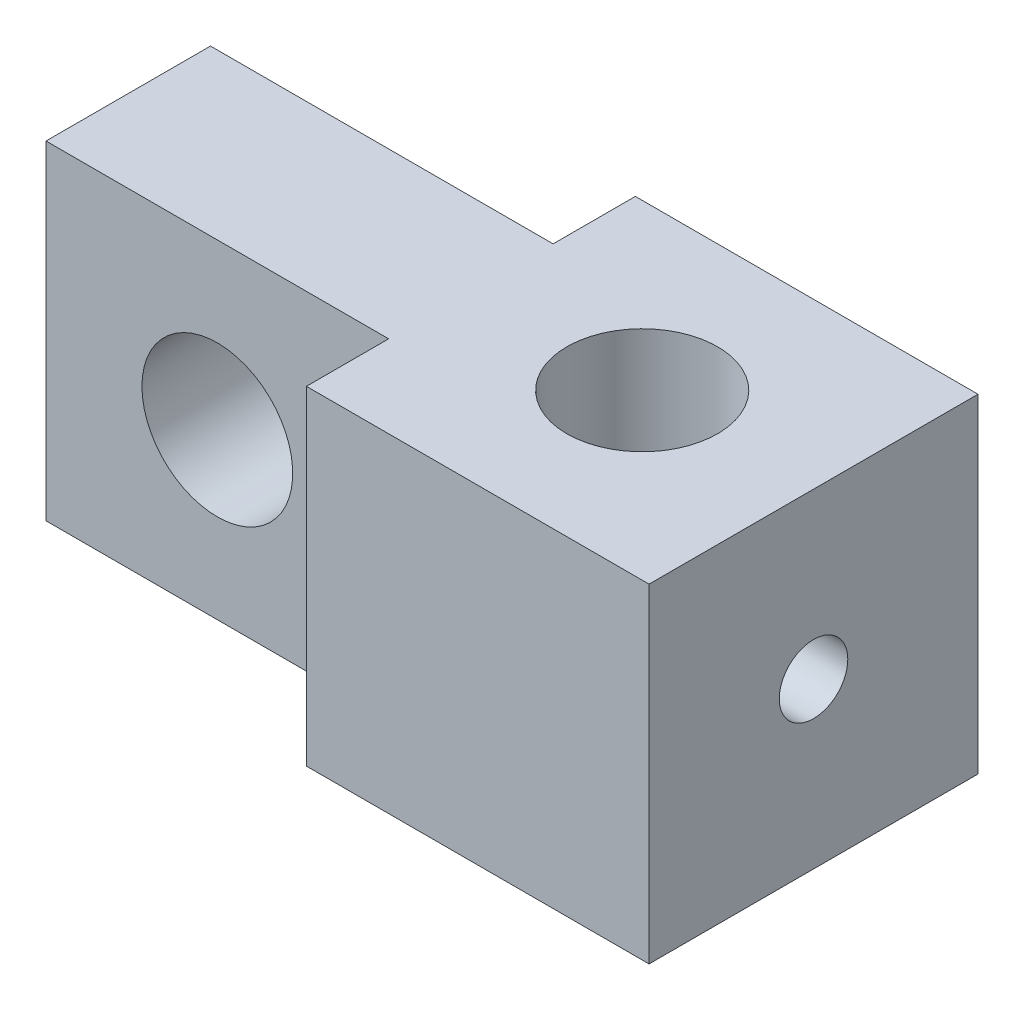
ISO-10303-21;
HEADER;
FILE_DESCRIPTION(('STEP AP214'),'2;1');
FILE_NAME('part.step','',(''),(''),'','','');
FILE_SCHEMA(('AUTOMOTIVE_DESIGN { 1 0 10303 214 1 1 1 1 }'));
ENDSEC;
DATA;
#1=APPLICATION_CONTEXT('core data for automotive mechanical design processes');
#2=APPLICATION_PROTOCOL_DEFINITION('international standard','automotive_design',2000,#1);
#3=PRODUCT_CONTEXT('',#1,'mechanical');
#4=PRODUCT('Part','Part','',(#3));
#5=PRODUCT_RELATED_PRODUCT_CATEGORY('part','',(#4));
#6=PRODUCT_DEFINITION_FORMATION('','',#4);
#7=PRODUCT_DEFINITION_CONTEXT('part definition',#1,'design');
#8=PRODUCT_DEFINITION('design','',#6,#7);
#9=PRODUCT_DEFINITION_SHAPE('','',#8);
#10=(LENGTH_UNIT() NAMED_UNIT(*) SI_UNIT(.MILLI.,.METRE.));
#11=(NAMED_UNIT(*) PLANE_ANGLE_UNIT() SI_UNIT($,.RADIAN.));
#12=(NAMED_UNIT(*) SI_UNIT($,.STERADIAN.) SOLID_ANGLE_UNIT());
#13=UNCERTAINTY_MEASURE_WITH_UNIT(LENGTH_MEASURE(1.E-05),#10,'distance_accuracy_value','');
#14=(GEOMETRIC_REPRESENTATION_CONTEXT(3) GLOBAL_UNCERTAINTY_ASSIGNED_CONTEXT((#13)) GLOBAL_UNIT_ASSIGNED_CONTEXT((#10,
#11,#12)) REPRESENTATION_CONTEXT('',''));
#15=CARTESIAN_POINT('',(0.,0.,0.));
#16=DIRECTION('',(0.,0.,1.));
#17=DIRECTION('',(1.,0.,0.));
#18=AXIS2_PLACEMENT_3D('',#15,#16,#17);
#19=CARTESIAN_POINT('',(0.,0.,6.));
#20=DIRECTION('',(0.,0.,1.));
#21=DIRECTION('',(1.,0.,0.));
#22=AXIS2_PLACEMENT_3D('',#19,#20,#21);
#23=PLANE('',#22);
#24=DIRECTION('',(0.,1.,0.));
#25=VECTOR('',#24,1.);
#26=CARTESIAN_POINT('',(0.,-6.,6.));
#27=LINE('',#26,#25);
#28=CARTESIAN_POINT('',(0.,-6.,6.));
#29=VERTEX_POINT('',#28);
#30=CARTESIAN_POINT('',(0.,6.,6.));
#31=VERTEX_POINT('',#30);
#32=EDGE_CURVE('E50',#29,#31,#27,.T.);
#33=ORIENTED_EDGE('',*,*,#32,.F.);
#34=DIRECTION('',(1.,0.,0.));
#35=VECTOR('',#34,1.);
#36=CARTESIAN_POINT('',(-12.5,-6.,6.));
#37=LINE('',#36,#35);
#38=CARTESIAN_POINT('',(12.5,-6.,6.));
#39=VERTEX_POINT('',#38);
#40=EDGE_CURVE('E112',#29,#39,#37,.T.);
#41=ORIENTED_EDGE('',*,*,#40,.T.);
#42=DIRECTION('',(0.,1.,0.));
#43=VECTOR('',#42,1.);
#44=CARTESIAN_POINT('',(12.5,6.,6.));
#45=LINE('',#44,#43);
#46=CARTESIAN_POINT('',(12.5,6.,6.));
#47=VERTEX_POINT('',#46);
#48=EDGE_CURVE('E120',#39,#47,#45,.T.);
#49=ORIENTED_EDGE('',*,*,#48,.T.);
#50=DIRECTION('',(-1.,0.,0.));
#51=VECTOR('',#50,1.);
#52=CARTESIAN_POINT('',(-12.5,6.,6.));
#53=LINE('',#52,#51);
#54=EDGE_CURVE('E115',#47,#31,#53,.T.);
#55=ORIENTED_EDGE('',*,*,#54,.T.);
#56=EDGE_LOOP('',(#33,#41,#49,#55));
#57=FACE_BOUND('',#56,.T.);
#58=ADVANCED_FACE('F33',(#57),#23,.T.);
#59=CARTESIAN_POINT('',(0.,0.,-6.));
#60=DIRECTION('',(0.,0.,1.));
#61=DIRECTION('',(1.,0.,0.));
#62=AXIS2_PLACEMENT_3D('',#59,#60,#61);
#63=PLANE('',#62);
#64=DIRECTION('',(1.,0.,0.));
#65=VECTOR('',#64,1.);
#66=CARTESIAN_POINT('',(-12.5,-6.,-6.));
#67=LINE('',#66,#65);
#68=CARTESIAN_POINT('',(0.,-6.,-6.));
#69=VERTEX_POINT('',#68);
#70=CARTESIAN_POINT('',(12.5,-6.,-6.));
#71=VERTEX_POINT('',#70);
#72=EDGE_CURVE('E132',#69,#71,#67,.T.);
#73=ORIENTED_EDGE('',*,*,#72,.F.);
#74=DIRECTION('',(0.,1.,0.));
#75=VECTOR('',#74,1.);
#76=CARTESIAN_POINT('',(0.,-6.,-6.));
#77=LINE('',#76,#75);
#78=CARTESIAN_POINT('',(0.,6.,-6.));
#79=VERTEX_POINT('',#78);
#80=EDGE_CURVE('E141',#69,#79,#77,.T.);
#81=ORIENTED_EDGE('',*,*,#80,.T.);
#82=DIRECTION('',(-1.,0.,0.));
#83=VECTOR('',#82,1.);
#84=CARTESIAN_POINT('',(-12.5,6.,-6.));
#85=LINE('',#84,#83);
#86=CARTESIAN_POINT('',(12.5,6.,-6.));
#87=VERTEX_POINT('',#86);
#88=EDGE_CURVE('E121',#87,#79,#85,.T.);
#89=ORIENTED_EDGE('',*,*,#88,.F.);
#90=DIRECTION('',(0.,1.,0.));
#91=VECTOR('',#90,1.);
#92=CARTESIAN_POINT('',(12.5,6.,-6.));
#93=LINE('',#92,#91);
#94=EDGE_CURVE('E125',#71,#87,#93,.T.);
#95=ORIENTED_EDGE('',*,*,#94,.F.);
#96=EDGE_LOOP('',(#73,#81,#89,#95));
#97=FACE_BOUND('',#96,.T.);
#98=ADVANCED_FACE('F214',(#97),#63,.F.);
#99=CARTESIAN_POINT('',(-12.5,6.,6.));
#100=DIRECTION('',(1.,0.,0.));
#101=DIRECTION('',(0.,0.,-1.));
#102=AXIS2_PLACEMENT_3D('',#99,#100,#101);
#103=PLANE('',#102);
#104=DIRECTION('',(0.,0.,-1.));
#105=VECTOR('',#104,1.);
#106=CARTESIAN_POINT('',(-12.5,-6.,6.));
#107=LINE('',#106,#105);
#108=CARTESIAN_POINT('',(-12.5,-6.,3.));
#109=VERTEX_POINT('',#108);
#110=CARTESIAN_POINT('',(-12.5,-6.,-3.));
#111=VERTEX_POINT('',#110);
#112=EDGE_CURVE('E11',#109,#111,#107,.T.);
#113=ORIENTED_EDGE('',*,*,#112,.F.);
#114=DIRECTION('',(0.,1.,0.));
#115=VECTOR('',#114,1.);
#116=CARTESIAN_POINT('',(-12.5,-6.,3.));
#117=LINE('',#116,#115);
#118=CARTESIAN_POINT('',(-12.5,6.,3.));
#119=VERTEX_POINT('',#118);
#120=EDGE_CURVE('E163',#109,#119,#117,.T.);
#121=ORIENTED_EDGE('',*,*,#120,.T.);
#122=DIRECTION('',(0.,0.,-1.));
#123=VECTOR('',#122,1.);
#124=CARTESIAN_POINT('',(-12.5,6.,6.));
#125=LINE('',#124,#123);
#126=CARTESIAN_POINT('',(-12.5,6.,-3.));
#127=VERTEX_POINT('',#126);
#128=EDGE_CURVE('E58',#119,#127,#125,.T.);
#129=ORIENTED_EDGE('',*,*,#128,.T.);
#130=DIRECTION('',(0.,1.,0.));
#131=VECTOR('',#130,1.);
#132=CARTESIAN_POINT('',(-12.5,-6.,-3.));
#133=LINE('',#132,#131);
#134=EDGE_CURVE('E128',#111,#127,#133,.T.);
#135=ORIENTED_EDGE('',*,*,#134,.F.);
#136=EDGE_LOOP('',(#113,#121,#129,#135));
#137=FACE_BOUND('',#136,.T.);
#138=ADVANCED_FACE('F35',(#137),#103,.F.);
#139=CARTESIAN_POINT('',(-12.5,-6.,6.));
#140=DIRECTION('',(0.,1.,0.));
#141=DIRECTION('',(0.,0.,1.));
#142=AXIS2_PLACEMENT_3D('',#139,#140,#141);
#143=PLANE('',#142);
#144=CARTESIAN_POINT('',(6.25,-6.,0.));
#145=DIRECTION('',(0.,1.,0.));
#146=DIRECTION('',(0.,0.,1.));
#147=AXIS2_PLACEMENT_3D('',#144,#145,#146);
#148=CIRCLE('',#147,2.75);
#149=CARTESIAN_POINT('',(6.25,-6.,2.75));
#150=VERTEX_POINT('',#149);
#151=EDGE_CURVE('E168',#150,#150,#148,.T.);
#152=ORIENTED_EDGE('',*,*,#151,.T.);
#153=EDGE_LOOP('',(#152));
#154=FACE_BOUND('',#153,.T.);
#155=DIRECTION('',(0.,0.,-1.));
#156=VECTOR('',#155,1.);
#157=CARTESIAN_POINT('',(0.,-6.,6.));
#158=LINE('',#157,#156);
#159=CARTESIAN_POINT('',(0.,-6.,3.));
#160=VERTEX_POINT('',#159);
#161=EDGE_CURVE('E100',#29,#160,#158,.T.);
#162=ORIENTED_EDGE('',*,*,#161,.T.);
#163=DIRECTION('',(-1.,0.,0.));
#164=VECTOR('',#163,1.);
#165=CARTESIAN_POINT('',(-12.5,-6.,3.));
#166=LINE('',#165,#164);
#167=EDGE_CURVE('E107',#160,#109,#166,.T.);
#168=ORIENTED_EDGE('',*,*,#167,.T.);
#169=ORIENTED_EDGE('',*,*,#112,.T.);
#170=DIRECTION('',(1.,0.,0.));
#171=VECTOR('',#170,1.);
#172=CARTESIAN_POINT('',(-12.5,-6.,-3.));
#173=LINE('',#172,#171);
#174=CARTESIAN_POINT('',(0.,-6.,-3.));
#175=VERTEX_POINT('',#174);
#176=EDGE_CURVE('E153',#111,#175,#173,.T.);
#177=ORIENTED_EDGE('',*,*,#176,.T.);
#178=DIRECTION('',(0.,0.,-1.));
#179=VECTOR('',#178,1.);
#180=CARTESIAN_POINT('',(0.,-6.,-6.));
#181=LINE('',#180,#179);
#182=EDGE_CURVE('E157',#175,#69,#181,.T.);
#183=ORIENTED_EDGE('',*,*,#182,.T.);
#184=ORIENTED_EDGE('',*,*,#72,.T.);
#185=DIRECTION('',(0.,0.,-1.));
#186=VECTOR('',#185,1.);
#187=CARTESIAN_POINT('',(12.5,-6.,6.));
#188=LINE('',#187,#186);
#189=EDGE_CURVE('E42',#39,#71,#188,.T.);
#190=ORIENTED_EDGE('',*,*,#189,.F.);
#191=ORIENTED_EDGE('',*,*,#40,.F.);
#192=EDGE_LOOP('',(#162,#168,#169,#177,#183,#184,#190,#191));
#193=FACE_BOUND('',#192,.T.);
#194=ADVANCED_FACE('F117',(#154,#193),#143,.F.);
#195=CARTESIAN_POINT('',(12.5,6.,6.));
#196=DIRECTION('',(-1.,0.,0.));
#197=DIRECTION('',(0.,0.,1.));
#198=AXIS2_PLACEMENT_3D('',#195,#196,#197);
#199=PLANE('',#198);
#200=CARTESIAN_POINT('',(12.5,0.,0.));
#201=DIRECTION('',(1.,0.,0.));
#202=DIRECTION('',(0.,0.,-1.));
#203=AXIS2_PLACEMENT_3D('',#200,#201,#202);
#204=CIRCLE('',#203,1.25);
#205=CARTESIAN_POINT('',(12.5,0.,-1.25));
#206=VERTEX_POINT('',#205);
#207=EDGE_CURVE('E173',#206,#206,#204,.T.);
#208=ORIENTED_EDGE('',*,*,#207,.F.);
#209=EDGE_LOOP('',(#208));
#210=FACE_BOUND('',#209,.T.);
#211=ORIENTED_EDGE('',*,*,#94,.T.);
#212=DIRECTION('',(0.,0.,-1.));
#213=VECTOR('',#212,1.);
#214=CARTESIAN_POINT('',(12.5,6.,6.));
#215=LINE('',#214,#213);
#216=EDGE_CURVE('E137',#47,#87,#215,.T.);
#217=ORIENTED_EDGE('',*,*,#216,.F.);
#218=ORIENTED_EDGE('',*,*,#48,.F.);
#219=ORIENTED_EDGE('',*,*,#189,.T.);
#220=EDGE_LOOP('',(#211,#217,#218,#219));
#221=FACE_BOUND('',#220,.T.);
#222=ADVANCED_FACE('F219',(#210,#221),#199,.F.);
#223=CARTESIAN_POINT('',(-12.5,6.,6.));
#224=DIRECTION('',(0.,-1.,0.));
#225=DIRECTION('',(0.,0.,-1.));
#226=AXIS2_PLACEMENT_3D('',#223,#224,#225);
#227=PLANE('',#226);
#228=CARTESIAN_POINT('',(6.25,6.,0.));
#229=DIRECTION('',(0.,1.,0.));
#230=DIRECTION('',(0.,0.,1.));
#231=AXIS2_PLACEMENT_3D('',#228,#229,#230);
#232=CIRCLE('',#231,2.75);
#233=CARTESIAN_POINT('',(6.25,6.,2.75));
#234=VERTEX_POINT('',#233);
#235=EDGE_CURVE('E170',#234,#234,#232,.T.);
#236=ORIENTED_EDGE('',*,*,#235,.F.);
#237=EDGE_LOOP('',(#236));
#238=FACE_BOUND('',#237,.T.);
#239=ORIENTED_EDGE('',*,*,#128,.F.);
#240=DIRECTION('',(-1.,0.,0.));
#241=VECTOR('',#240,1.);
#242=CARTESIAN_POINT('',(-12.5,6.,3.));
#243=LINE('',#242,#241);
#244=CARTESIAN_POINT('',(0.,6.,3.));
#245=VERTEX_POINT('',#244);
#246=EDGE_CURVE('E108',#245,#119,#243,.T.);
#247=ORIENTED_EDGE('',*,*,#246,.F.);
#248=DIRECTION('',(0.,0.,-1.));
#249=VECTOR('',#248,1.);
#250=CARTESIAN_POINT('',(0.,6.,6.));
#251=LINE('',#250,#249);
#252=EDGE_CURVE('E166',#31,#245,#251,.T.);
#253=ORIENTED_EDGE('',*,*,#252,.F.);
#254=ORIENTED_EDGE('',*,*,#54,.F.);
#255=ORIENTED_EDGE('',*,*,#216,.T.);
#256=ORIENTED_EDGE('',*,*,#88,.T.);
#257=DIRECTION('',(0.,0.,-1.));
#258=VECTOR('',#257,1.);
#259=CARTESIAN_POINT('',(0.,6.,-6.));
#260=LINE('',#259,#258);
#261=CARTESIAN_POINT('',(0.,6.,-3.));
#262=VERTEX_POINT('',#261);
#263=EDGE_CURVE('E151',#262,#79,#260,.T.);
#264=ORIENTED_EDGE('',*,*,#263,.F.);
#265=DIRECTION('',(1.,0.,0.));
#266=VECTOR('',#265,1.);
#267=CARTESIAN_POINT('',(-12.5,6.,-3.));
#268=LINE('',#267,#266);
#269=EDGE_CURVE('E154',#127,#262,#268,.T.);
#270=ORIENTED_EDGE('',*,*,#269,.F.);
#271=EDGE_LOOP('',(#239,#247,#253,#254,#255,#256,#264,#270));
#272=FACE_BOUND('',#271,.T.);
#273=ADVANCED_FACE('F210',(#238,#272),#227,.F.);
#274=CARTESIAN_POINT('',(-6.25,0.,6.));
#275=DIRECTION('',(0.,0.,-1.));
#276=DIRECTION('',(-1.,0.,0.));
#277=AXIS2_PLACEMENT_3D('',#274,#275,#276);
#278=CYLINDRICAL_SURFACE('',#277,2.75);
#279=CARTESIAN_POINT('',(-6.25,0.,3.));
#280=DIRECTION('',(0.,0.,-1.));
#281=DIRECTION('',(-1.,0.,0.));
#282=AXIS2_PLACEMENT_3D('',#279,#280,#281);
#283=CIRCLE('',#282,2.75);
#284=CARTESIAN_POINT('',(-9.,0.,3.));
#285=VERTEX_POINT('',#284);
#286=EDGE_CURVE('E37',#285,#285,#283,.T.);
#287=ORIENTED_EDGE('',*,*,#286,.F.);
#288=EDGE_LOOP('',(#287));
#289=FACE_BOUND('',#288,.T.);
#290=CARTESIAN_POINT('',(-6.25,0.,-3.));
#291=DIRECTION('',(0.,0.,1.));
#292=DIRECTION('',(1.,0.,0.));
#293=AXIS2_PLACEMENT_3D('',#290,#291,#292);
#294=CIRCLE('',#293,2.75);
#295=CARTESIAN_POINT('',(-3.5,0.,-3.));
#296=VERTEX_POINT('',#295);
#297=EDGE_CURVE('E134',#296,#296,#294,.T.);
#298=ORIENTED_EDGE('',*,*,#297,.F.);
#299=EDGE_LOOP('',(#298));
#300=FACE_BOUND('',#299,.T.);
#301=ADVANCED_FACE('F204',(#289,#300),#278,.F.);
#302=CARTESIAN_POINT('',(0.,-6.,-6.));
#303=DIRECTION('',(1.,0.,0.));
#304=DIRECTION('',(0.,0.,-1.));
#305=AXIS2_PLACEMENT_3D('',#302,#303,#304);
#306=PLANE('',#305);
#307=ORIENTED_EDGE('',*,*,#263,.T.);
#308=ORIENTED_EDGE('',*,*,#80,.F.);
#309=ORIENTED_EDGE('',*,*,#182,.F.);
#310=DIRECTION('',(0.,1.,0.));
#311=VECTOR('',#310,1.);
#312=CARTESIAN_POINT('',(0.,-6.,-3.));
#313=LINE('',#312,#311);
#314=EDGE_CURVE('E145',#175,#262,#313,.T.);
#315=ORIENTED_EDGE('',*,*,#314,.T.);
#316=EDGE_LOOP('',(#307,#308,#309,#315));
#317=FACE_BOUND('',#316,.T.);
#318=ADVANCED_FACE('F201',(#317),#306,.F.);
#319=CARTESIAN_POINT('',(-12.5,-6.,-3.));
#320=DIRECTION('',(0.,0.,1.));
#321=DIRECTION('',(1.,0.,0.));
#322=AXIS2_PLACEMENT_3D('',#319,#320,#321);
#323=PLANE('',#322);
#324=ORIENTED_EDGE('',*,*,#297,.T.);
#325=EDGE_LOOP('',(#324));
#326=FACE_BOUND('',#325,.T.);
#327=ORIENTED_EDGE('',*,*,#269,.T.);
#328=ORIENTED_EDGE('',*,*,#314,.F.);
#329=ORIENTED_EDGE('',*,*,#176,.F.);
#330=ORIENTED_EDGE('',*,*,#134,.T.);
#331=EDGE_LOOP('',(#327,#328,#329,#330));
#332=FACE_BOUND('',#331,.T.);
#333=ADVANCED_FACE('F197',(#326,#332),#323,.F.);
#334=CARTESIAN_POINT('',(-12.5,-6.,3.));
#335=DIRECTION('',(0.,0.,-1.));
#336=DIRECTION('',(-1.,0.,0.));
#337=AXIS2_PLACEMENT_3D('',#334,#335,#336);
#338=PLANE('',#337);
#339=ORIENTED_EDGE('',*,*,#286,.T.);
#340=EDGE_LOOP('',(#339));
#341=FACE_BOUND('',#340,.T.);
#342=ORIENTED_EDGE('',*,*,#246,.T.);
#343=ORIENTED_EDGE('',*,*,#120,.F.);
#344=ORIENTED_EDGE('',*,*,#167,.F.);
#345=DIRECTION('',(0.,1.,0.));
#346=VECTOR('',#345,1.);
#347=CARTESIAN_POINT('',(0.,-6.,3.));
#348=LINE('',#347,#346);
#349=EDGE_CURVE('E102',#160,#245,#348,.T.);
#350=ORIENTED_EDGE('',*,*,#349,.T.);
#351=EDGE_LOOP('',(#342,#343,#344,#350));
#352=FACE_BOUND('',#351,.T.);
#353=ADVANCED_FACE('F194',(#341,#352),#338,.F.);
#354=CARTESIAN_POINT('',(0.,-6.,6.));
#355=DIRECTION('',(1.,0.,0.));
#356=DIRECTION('',(0.,0.,-1.));
#357=AXIS2_PLACEMENT_3D('',#354,#355,#356);
#358=PLANE('',#357);
#359=ORIENTED_EDGE('',*,*,#252,.T.);
#360=ORIENTED_EDGE('',*,*,#349,.F.);
#361=ORIENTED_EDGE('',*,*,#161,.F.);
#362=ORIENTED_EDGE('',*,*,#32,.T.);
#363=EDGE_LOOP('',(#359,#360,#361,#362));
#364=FACE_BOUND('',#363,.T.);
#365=ADVANCED_FACE('F101',(#364),#358,.F.);
#366=CARTESIAN_POINT('',(6.25,-6.,0.));
#367=DIRECTION('',(0.,1.,0.));
#368=DIRECTION('',(0.,0.,1.));
#369=AXIS2_PLACEMENT_3D('',#366,#367,#368);
#370=CYLINDRICAL_SURFACE('',#369,2.75);
#371=CARTESIAN_POINT('',(8.69948974278318,0.,-1.25));
#372=CARTESIAN_POINT('',(8.69949368228765,-0.0660084287767302,-1.24999649350401));
#373=CARTESIAN_POINT('',(8.70219701957715,-0.132119822013389,-1.24473782444839));
#374=CARTESIAN_POINT('',(8.71264090706275,-0.262382350963878,-1.22393957837268));
#375=CARTESIAN_POINT('',(8.72039386281898,-0.326528250543144,-1.20837468013772));
#376=CARTESIAN_POINT('',(8.7398625437228,-0.450738534262838,-1.16772642001968));
#377=CARTESIAN_POINT('',(8.75155999360655,-0.510820234270489,-1.14268689094073));
#378=CARTESIAN_POINT('',(8.77757186133796,-0.625915092937396,-1.08393224916963));
#379=CARTESIAN_POINT('',(8.79188600196967,-0.680928787580735,-1.0502180553298));
#380=CARTESIAN_POINT('',(8.82270625364897,-0.788447136632088,-0.972392408700567));
#381=CARTESIAN_POINT('',(8.83929511801968,-0.840531232248649,-0.927732432282868));
#382=CARTESIAN_POINT('',(8.87212163999063,-0.936788274207381,-0.83043006696106));
#383=CARTESIAN_POINT('',(8.88835914368329,-0.980957813013366,-0.777784257759751));
#384=CARTESIAN_POINT('',(8.91969243866209,-1.06242556643034,-0.662562027156216));
#385=CARTESIAN_POINT('',(8.93468107121253,-1.09923134724531,-0.599605600022139));
#386=CARTESIAN_POINT('',(8.96078910043921,-1.16154249571663,-0.467587746509004));
#387=CARTESIAN_POINT('',(8.97191052506912,-1.18705378809647,-0.3985295437857));
#388=CARTESIAN_POINT('',(8.98844039615751,-1.22446716705338,-0.260702263713023));
#389=CARTESIAN_POINT('',(8.99415398467794,-1.23709974866422,-0.192168860207233));
#390=CARTESIAN_POINT('',(9.00034616684861,-1.25077724031198,-0.0537337492110699));
#391=CARTESIAN_POINT('',(9.00082731987365,-1.25182781553358,0.0161672725634619));
#392=CARTESIAN_POINT('',(8.99666518415707,-1.24265098655335,0.149965080853623));
#393=CARTESIAN_POINT('',(8.99238926124843,-1.23323213235261,0.213931079826317));
#394=CARTESIAN_POINT('',(8.97972015837753,-1.20479606682559,0.339258309266341));
#395=CARTESIAN_POINT('',(8.97132667311911,-1.18577814377447,0.400619346222468));
#396=CARTESIAN_POINT('',(8.95105493201454,-1.13848998410525,0.520129625913246));
#397=CARTESIAN_POINT('',(8.93912586975713,-1.11008410479753,0.578216222535323));
#398=CARTESIAN_POINT('',(8.91291017293157,-1.04497733314685,0.688949986561351));
#399=CARTESIAN_POINT('',(8.89862267537057,-1.00827340257749,0.741595151340298));
#400=CARTESIAN_POINT('',(8.8677092389954,-0.924150244355839,0.844521462681012));
#401=CARTESIAN_POINT('',(8.85098761803526,-0.876101352862837,0.894259880394284));
#402=CARTESIAN_POINT('',(8.81790977516793,-0.772382876987363,0.98523466528176));
#403=CARTESIAN_POINT('',(8.801553755853,-0.71670918353218,1.02646641790382));
#404=CARTESIAN_POINT('',(8.77029978809172,-0.5961900503594,1.10104506894183));
#405=CARTESIAN_POINT('',(8.75550118974752,-0.53104375001056,1.13395121798234));
#406=CARTESIAN_POINT('',(8.73028797326795,-0.395289669846359,1.18809667415591));
#407=CARTESIAN_POINT('',(8.71986954528397,-0.324686699764859,1.20934612514665));
#408=CARTESIAN_POINT('',(8.70559834607939,-0.185471789564966,1.23805393738082));
#409=CARTESIAN_POINT('',(8.70132366398273,-0.117087689105074,1.24640186410719));
#410=CARTESIAN_POINT('',(8.69861334601462,0.0202232972106237,1.25172089001372));
#411=CARTESIAN_POINT('',(8.7001749518254,0.0891499112995525,1.24869736351006));
#412=CARTESIAN_POINT('',(8.70851920297554,0.219568266954127,1.23217422693461));
#413=CARTESIAN_POINT('',(8.71486058692079,0.281204327780296,1.21955926621107));
#414=CARTESIAN_POINT('',(8.73144703005369,0.401407597426304,1.18544405201489));
#415=CARTESIAN_POINT('',(8.74169312725522,0.459973985502817,1.16394143575354));
#416=CARTESIAN_POINT('',(8.76549375704146,0.575365236199451,1.11159822979467));
#417=CARTESIAN_POINT('',(8.77917735570445,0.631990372421137,1.08037807246866));
#418=CARTESIAN_POINT('',(8.80815836558198,0.739499600550339,1.00984087724324));
#419=CARTESIAN_POINT('',(8.82345655287928,0.790380907034867,0.970519936824044));
#420=CARTESIAN_POINT('',(8.85579094908277,0.890281305937399,0.880267857698434));
#421=CARTESIAN_POINT('',(8.87284763397897,0.938602233674575,0.828567938261524));
#422=CARTESIAN_POINT('',(8.90539591051489,1.02604911327505,0.717441468187276));
#423=CARTESIAN_POINT('',(8.92088723447428,1.06517349401948,0.658013600012913));
#424=CARTESIAN_POINT('',(8.94881612600612,1.13339748332452,0.532064634336914));
#425=CARTESIAN_POINT('',(8.96121763780736,1.16238019367691,0.465471699055596));
#426=CARTESIAN_POINT('',(8.98129834562412,1.20848045633376,0.32763598048205));
#427=CARTESIAN_POINT('',(8.98898094374761,1.22560655781336,0.256396588146287));
#428=CARTESIAN_POINT('',(8.99830068808534,1.24628759006366,0.117466176582589));
#429=CARTESIAN_POINT('',(9.00037367442807,1.25082169423424,0.0499494636179373));
#430=CARTESIAN_POINT('',(8.99951533998593,1.24893412790421,-0.0848898576600104));
#431=CARTESIAN_POINT('',(8.99658522376393,1.24251509451602,-0.152212508787338));
#432=CARTESIAN_POINT('',(8.98629690997646,1.21959722272619,-0.281391999197495));
#433=CARTESIAN_POINT('',(8.9791576129465,1.2035960996597,-0.343356169931416));
#434=CARTESIAN_POINT('',(8.96131278427636,1.16256495626254,-0.463664188063035));
#435=CARTESIAN_POINT('',(8.95060664770133,1.13753340431434,-0.522007419358067));
#436=CARTESIAN_POINT('',(8.9260233581899,1.07790145857027,-0.636378008545816));
#437=CARTESIAN_POINT('',(8.91202358016364,1.04291581669571,-0.692177439915823));
#438=CARTESIAN_POINT('',(8.88243399966462,0.964889219457324,-0.79735904510521));
#439=CARTESIAN_POINT('',(8.86684350365391,0.921844743630817,-0.846738398309347));
#440=CARTESIAN_POINT('',(8.8341761482303,0.824757235269181,-0.941951228398709));
#441=CARTESIAN_POINT('',(8.81708296999994,0.770099102757161,-0.987154004244788));
#442=CARTESIAN_POINT('',(8.78455914709152,0.653541400342759,-1.06790018403238));
#443=CARTESIAN_POINT('',(8.76912960228939,0.591637095502227,-1.10343722102545));
#444=CARTESIAN_POINT('',(8.74176565985743,0.461487542492061,-1.16392442382467));
#445=CARTESIAN_POINT('',(8.72986003874526,0.393195774976169,-1.18878813351711));
#446=CARTESIAN_POINT('',(8.71152275925821,0.252764165808893,-1.22631765086683));
#447=CARTESIAN_POINT('',(8.70507273502283,0.180638110745491,-1.23902440311467));
#448=CARTESIAN_POINT('',(8.70107611117236,0.0900089019027595,-1.24688636059436));
#449=CARTESIAN_POINT('',(8.70048261290848,0.0720345562265871,-1.24805272823733));
#450=CARTESIAN_POINT('',(8.69968888381115,0.0360427007122043,-1.2496100405375));
#451=CARTESIAN_POINT('',(8.69948866700671,0.0180251893571555,-1.25000095753308));
#452=CARTESIAN_POINT('',(8.69948974278318,0.,-1.25));
#453=B_SPLINE_CURVE_WITH_KNOTS('',3,(#371,#372,#373,#374,#375,#376,#377,#378,#379,#380,#381,
#382,#383,#384,#385,#386,#387,#388,#389,#390,#391,#392,#393,#394,#395,#396,#397,#398,#399,#400,
#401,#402,#403,#404,#405,#406,#407,#408,#409,#410,#411,#412,#413,#414,#415,#416,#417,#418,#419,
#420,#421,#422,#423,#424,#425,#426,#427,#428,#429,#430,#431,#432,#433,#434,#435,#436,#437,#438,
#439,#440,#441,#442,#443,#444,#445,#446,#447,#448,#449,#450,#451,#452),.UNSPECIFIED.,.T.,.F.,(4,
2,2,2,2,2,2,2,2,2,2,2,2,2,2,2,2,2,2,2,2,2,2,2,2,2,2,2,2,2,2,2,2,2,2,2,2,2,2,2,4),(0.,
0.197949490145133,0.396387132894558,0.593917744022092,0.791427440589958,1.00227982105295,
1.21322276498815,1.43542192427071,1.65750438655095,1.86613997239169,2.07467350237463,
2.26815547775456,2.46165180100119,2.65807591784026,2.85457206969011,3.06708946120133,
3.27972183419202,3.50196731162577,3.72401907920019,3.92994297853522,4.13576956743683,
4.32461933407749,4.51351933887032,4.71099397075556,4.90856395864764,5.12594226056978,
5.34335767200034,5.56320241144759,5.78288846688928,5.98493699995732,6.18693689403808,
6.37925788088371,6.57161150192545,6.77276176443707,6.97400010437291,7.19187634216838,
7.40989575221212,7.62964928571055,7.8486600571131,7.90271299908978,7.95676786918959),.UNSPECIFIED.);
#454=CARTESIAN_POINT('',(8.69948974278318,0.,-1.25));
#455=VERTEX_POINT('',#454);
#456=EDGE_CURVE('E178',#455,#455,#453,.T.);
#457=ORIENTED_EDGE('',*,*,#456,.F.);
#458=EDGE_LOOP('',(#457));
#459=FACE_BOUND('',#458,.T.);
#460=ORIENTED_EDGE('',*,*,#151,.F.);
#461=EDGE_LOOP('',(#460));
#462=FACE_BOUND('',#461,.T.);
#463=ORIENTED_EDGE('',*,*,#235,.T.);
#464=EDGE_LOOP('',(#463));
#465=FACE_BOUND('',#464,.T.);
#466=ADVANCED_FACE('F189',(#459,#462,#465),#370,.F.);
#467=CARTESIAN_POINT('',(-12.501,0.,0.));
#468=DIRECTION('',(1.,0.,0.));
#469=DIRECTION('',(0.,0.,-1.));
#470=AXIS2_PLACEMENT_3D('',#467,#468,#469);
#471=CYLINDRICAL_SURFACE('',#470,1.25);
#472=ORIENTED_EDGE('',*,*,#207,.T.);
#473=EDGE_LOOP('',(#472));
#474=FACE_BOUND('',#473,.T.);
#475=ORIENTED_EDGE('',*,*,#456,.T.);
#476=EDGE_LOOP('',(#475));
#477=FACE_BOUND('',#476,.T.);
#478=ADVANCED_FACE('F184',(#474,#477),#471,.F.);
#479=CLOSED_SHELL('',(#58,#98,#138,#194,#222,#273,#301,#318,#333,#353,#365,#466,#478));
#480=MANIFOLD_SOLID_BREP('B2',#479);
#481=ADVANCED_BREP_SHAPE_REPRESENTATION('',(#18,#480),#14);
#482=SHAPE_DEFINITION_REPRESENTATION(#9,#481);
ENDSEC;
END-ISO-10303-21;
